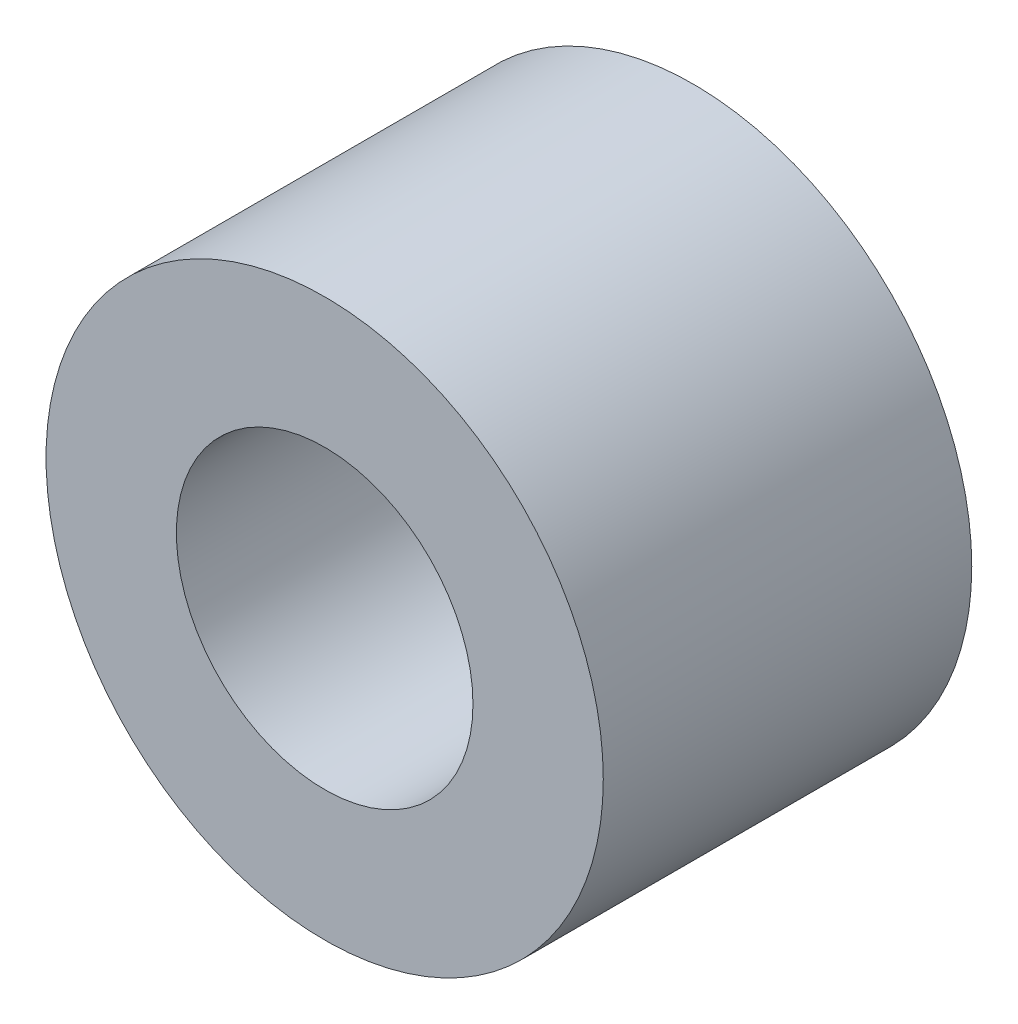
ISO-10303-21;
HEADER;
FILE_DESCRIPTION(('STEP AP214'),'2;1');
FILE_NAME('part.step','',(''),(''),'','','');
FILE_SCHEMA(('AUTOMOTIVE_DESIGN { 1 0 10303 214 1 1 1 1 }'));
ENDSEC;
DATA;
#1=APPLICATION_CONTEXT('core data for automotive mechanical design processes');
#2=APPLICATION_PROTOCOL_DEFINITION('international standard','automotive_design',2000,#1);
#3=PRODUCT_CONTEXT('',#1,'mechanical');
#4=PRODUCT('Part','Part','',(#3));
#5=PRODUCT_RELATED_PRODUCT_CATEGORY('part','',(#4));
#6=PRODUCT_DEFINITION_FORMATION('','',#4);
#7=PRODUCT_DEFINITION_CONTEXT('part definition',#1,'design');
#8=PRODUCT_DEFINITION('design','',#6,#7);
#9=PRODUCT_DEFINITION_SHAPE('','',#8);
#10=(LENGTH_UNIT() NAMED_UNIT(*) SI_UNIT(.MILLI.,.METRE.));
#11=(NAMED_UNIT(*) PLANE_ANGLE_UNIT() SI_UNIT($,.RADIAN.));
#12=(NAMED_UNIT(*) SI_UNIT($,.STERADIAN.) SOLID_ANGLE_UNIT());
#13=UNCERTAINTY_MEASURE_WITH_UNIT(LENGTH_MEASURE(1.E-05),#10,'distance_accuracy_value','');
#14=(GEOMETRIC_REPRESENTATION_CONTEXT(3) GLOBAL_UNCERTAINTY_ASSIGNED_CONTEXT((#13)) GLOBAL_UNIT_ASSIGNED_CONTEXT((#10,
#11,#12)) REPRESENTATION_CONTEXT('',''));
#15=CARTESIAN_POINT('',(0.,0.,0.));
#16=DIRECTION('',(0.,0.,1.));
#17=DIRECTION('',(1.,0.,0.));
#18=AXIS2_PLACEMENT_3D('',#15,#16,#17);
#19=CARTESIAN_POINT('',(0.,0.,4.1));
#20=DIRECTION('',(0.,0.,1.));
#21=DIRECTION('',(1.,0.,0.));
#22=AXIS2_PLACEMENT_3D('',#19,#20,#21);
#23=PLANE('',#22);
#24=CARTESIAN_POINT('',(0.,0.,4.1));
#25=DIRECTION('',(0.,0.,1.));
#26=DIRECTION('',(1.,0.,0.));
#27=AXIS2_PLACEMENT_3D('',#24,#25,#26);
#28=CIRCLE('',#27,3.1);
#29=CARTESIAN_POINT('',(3.1,0.,4.1));
#30=VERTEX_POINT('',#29);
#31=EDGE_CURVE('E10',#30,#30,#28,.T.);
#32=ORIENTED_EDGE('',*,*,#31,.T.);
#33=EDGE_LOOP('',(#32));
#34=FACE_BOUND('',#33,.T.);
#35=CARTESIAN_POINT('',(0.,0.,4.1));
#36=DIRECTION('',(0.,0.,1.));
#37=DIRECTION('',(1.,0.,0.));
#38=AXIS2_PLACEMENT_3D('',#35,#36,#37);
#39=CIRCLE('',#38,1.65);
#40=CARTESIAN_POINT('',(1.65,0.,4.1));
#41=VERTEX_POINT('',#40);
#42=EDGE_CURVE('E54',#41,#41,#39,.T.);
#43=ORIENTED_EDGE('',*,*,#42,.F.);
#44=EDGE_LOOP('',(#43));
#45=FACE_BOUND('',#44,.T.);
#46=ADVANCED_FACE('F41',(#34,#45),#23,.T.);
#47=CARTESIAN_POINT('',(0.,0.,0.));
#48=DIRECTION('',(0.,0.,1.));
#49=DIRECTION('',(1.,0.,0.));
#50=AXIS2_PLACEMENT_3D('',#47,#48,#49);
#51=PLANE('',#50);
#52=CARTESIAN_POINT('',(0.,0.,0.));
#53=DIRECTION('',(0.,0.,1.));
#54=DIRECTION('',(1.,0.,0.));
#55=AXIS2_PLACEMENT_3D('',#52,#53,#54);
#56=CIRCLE('',#55,3.1);
#57=CARTESIAN_POINT('',(3.1,0.,0.));
#58=VERTEX_POINT('',#57);
#59=EDGE_CURVE('E45',#58,#58,#56,.T.);
#60=ORIENTED_EDGE('',*,*,#59,.F.);
#61=EDGE_LOOP('',(#60));
#62=FACE_BOUND('',#61,.T.);
#63=CARTESIAN_POINT('',(0.,0.,0.));
#64=DIRECTION('',(0.,0.,1.));
#65=DIRECTION('',(1.,0.,0.));
#66=AXIS2_PLACEMENT_3D('',#63,#64,#65);
#67=CIRCLE('',#66,1.65);
#68=CARTESIAN_POINT('',(1.65,0.,0.));
#69=VERTEX_POINT('',#68);
#70=EDGE_CURVE('E56',#69,#69,#67,.T.);
#71=ORIENTED_EDGE('',*,*,#70,.T.);
#72=EDGE_LOOP('',(#71));
#73=FACE_BOUND('',#72,.T.);
#74=ADVANCED_FACE('F68',(#62,#73),#51,.F.);
#75=CARTESIAN_POINT('',(0.,0.,4.1));
#76=DIRECTION('',(0.,0.,-1.));
#77=DIRECTION('',(-1.,0.,0.));
#78=AXIS2_PLACEMENT_3D('',#75,#76,#77);
#79=CYLINDRICAL_SURFACE('',#78,3.1);
#80=ORIENTED_EDGE('',*,*,#31,.F.);
#81=EDGE_LOOP('',(#80));
#82=FACE_BOUND('',#81,.T.);
#83=ORIENTED_EDGE('',*,*,#59,.T.);
#84=EDGE_LOOP('',(#83));
#85=FACE_BOUND('',#84,.T.);
#86=ADVANCED_FACE('F43',(#82,#85),#79,.T.);
#87=CARTESIAN_POINT('',(0.,0.,4.1));
#88=DIRECTION('',(0.,0.,-1.));
#89=DIRECTION('',(-1.,0.,0.));
#90=AXIS2_PLACEMENT_3D('',#87,#88,#89);
#91=CYLINDRICAL_SURFACE('',#90,1.65);
#92=ORIENTED_EDGE('',*,*,#42,.T.);
#93=EDGE_LOOP('',(#92));
#94=FACE_BOUND('',#93,.T.);
#95=ORIENTED_EDGE('',*,*,#70,.F.);
#96=EDGE_LOOP('',(#95));
#97=FACE_BOUND('',#96,.T.);
#98=ADVANCED_FACE('F64',(#94,#97),#91,.F.);
#99=CLOSED_SHELL('',(#46,#74,#86,#98));
#100=MANIFOLD_SOLID_BREP('B2',#99);
#101=ADVANCED_BREP_SHAPE_REPRESENTATION('',(#18,#100),#14);
#102=SHAPE_DEFINITION_REPRESENTATION(#9,#101);
ENDSEC;
END-ISO-10303-21;
